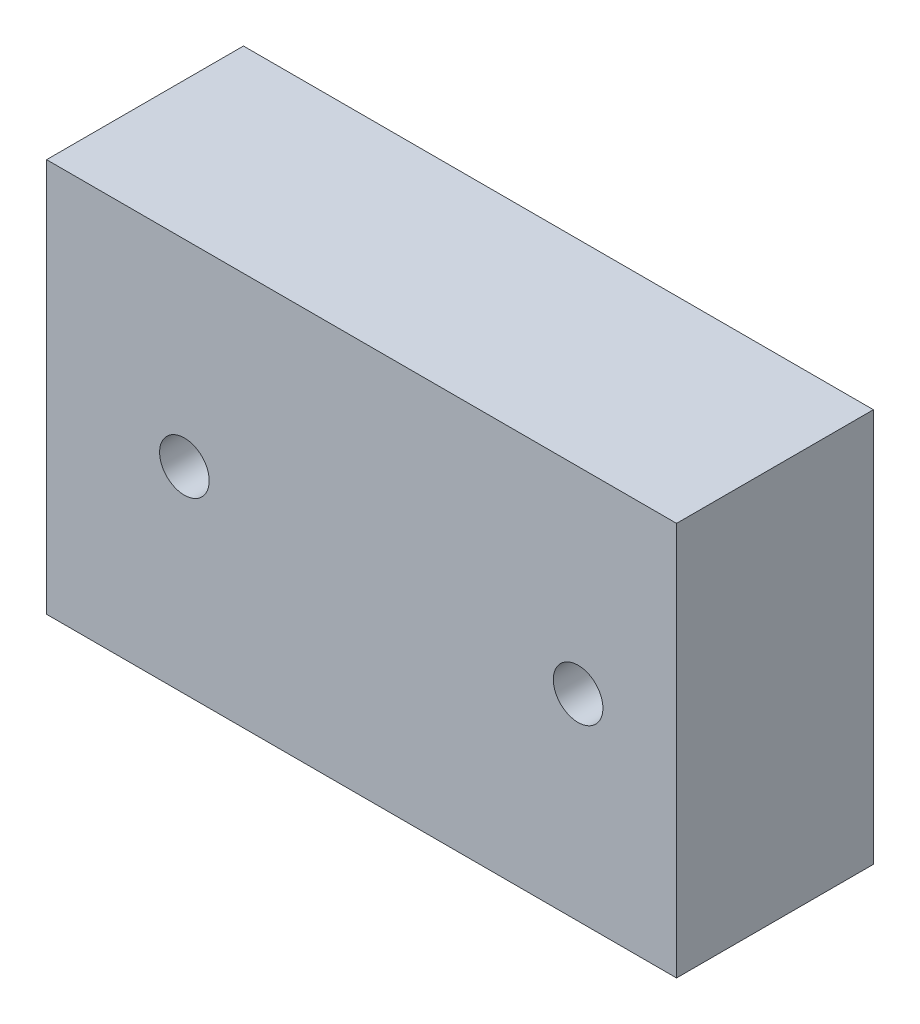
ISO-10303-21;
HEADER;
FILE_DESCRIPTION(('STEP AP214'),'2;1');
FILE_NAME('part.step','',(''),(''),'','','');
FILE_SCHEMA(('AUTOMOTIVE_DESIGN { 1 0 10303 214 1 1 1 1 }'));
ENDSEC;
DATA;
#1=APPLICATION_CONTEXT('core data for automotive mechanical design processes');
#2=APPLICATION_PROTOCOL_DEFINITION('international standard','automotive_design',2000,#1);
#3=PRODUCT_CONTEXT('',#1,'mechanical');
#4=PRODUCT('Part','Part','',(#3));
#5=PRODUCT_RELATED_PRODUCT_CATEGORY('part','',(#4));
#6=PRODUCT_DEFINITION_FORMATION('','',#4);
#7=PRODUCT_DEFINITION_CONTEXT('part definition',#1,'design');
#8=PRODUCT_DEFINITION('design','',#6,#7);
#9=PRODUCT_DEFINITION_SHAPE('','',#8);
#10=(LENGTH_UNIT() NAMED_UNIT(*) SI_UNIT(.MILLI.,.METRE.));
#11=(NAMED_UNIT(*) PLANE_ANGLE_UNIT() SI_UNIT($,.RADIAN.));
#12=(NAMED_UNIT(*) SI_UNIT($,.STERADIAN.) SOLID_ANGLE_UNIT());
#13=UNCERTAINTY_MEASURE_WITH_UNIT(LENGTH_MEASURE(1.E-05),#10,'distance_accuracy_value','');
#14=(GEOMETRIC_REPRESENTATION_CONTEXT(3) GLOBAL_UNCERTAINTY_ASSIGNED_CONTEXT((#13)) GLOBAL_UNIT_ASSIGNED_CONTEXT((#10,
#11,#12)) REPRESENTATION_CONTEXT('',''));
#15=CARTESIAN_POINT('',(0.,0.,0.));
#16=DIRECTION('',(0.,0.,1.));
#17=DIRECTION('',(1.,0.,0.));
#18=AXIS2_PLACEMENT_3D('',#15,#16,#17);
#19=CARTESIAN_POINT('',(0.,0.,6.35));
#20=DIRECTION('',(1.,0.,0.));
#21=DIRECTION('',(0.,0.,-1.));
#22=AXIS2_PLACEMENT_3D('',#19,#20,#21);
#23=PLANE('',#22);
#24=DIRECTION('',(0.,-1.,0.));
#25=VECTOR('',#24,1.);
#26=CARTESIAN_POINT('',(0.,0.,0.));
#27=LINE('',#26,#25);
#28=CARTESIAN_POINT('',(0.,12.7,0.));
#29=VERTEX_POINT('',#28);
#30=CARTESIAN_POINT('',(0.,0.,0.));
#31=VERTEX_POINT('',#30);
#32=EDGE_CURVE('E101',#29,#31,#27,.T.);
#33=ORIENTED_EDGE('',*,*,#32,.T.);
#34=DIRECTION('',(0.,0.,-1.));
#35=VECTOR('',#34,1.);
#36=CARTESIAN_POINT('',(0.,0.,6.35));
#37=LINE('',#36,#35);
#38=CARTESIAN_POINT('',(0.,0.,6.35));
#39=VERTEX_POINT('',#38);
#40=EDGE_CURVE('E11',#39,#31,#37,.T.);
#41=ORIENTED_EDGE('',*,*,#40,.F.);
#42=DIRECTION('',(0.,-1.,0.));
#43=VECTOR('',#42,1.);
#44=CARTESIAN_POINT('',(0.,0.,6.35));
#45=LINE('',#44,#43);
#46=CARTESIAN_POINT('',(0.,12.7,6.35));
#47=VERTEX_POINT('',#46);
#48=EDGE_CURVE('E89',#47,#39,#45,.T.);
#49=ORIENTED_EDGE('',*,*,#48,.F.);
#50=DIRECTION('',(0.,0.,-1.));
#51=VECTOR('',#50,1.);
#52=CARTESIAN_POINT('',(0.,12.7,6.35));
#53=LINE('',#52,#51);
#54=EDGE_CURVE('E97',#47,#29,#53,.T.);
#55=ORIENTED_EDGE('',*,*,#54,.T.);
#56=EDGE_LOOP('',(#33,#41,#49,#55));
#57=FACE_BOUND('',#56,.T.);
#58=ADVANCED_FACE('F38',(#57),#23,.F.);
#59=CARTESIAN_POINT('',(0.,0.,6.35));
#60=DIRECTION('',(0.,1.,0.));
#61=DIRECTION('',(0.,0.,1.));
#62=AXIS2_PLACEMENT_3D('',#59,#60,#61);
#63=PLANE('',#62);
#64=DIRECTION('',(1.,0.,0.));
#65=VECTOR('',#64,1.);
#66=CARTESIAN_POINT('',(0.,0.,0.));
#67=LINE('',#66,#65);
#68=CARTESIAN_POINT('',(20.32,0.,0.));
#69=VERTEX_POINT('',#68);
#70=EDGE_CURVE('E93',#31,#69,#67,.T.);
#71=ORIENTED_EDGE('',*,*,#70,.T.);
#72=DIRECTION('',(0.,0.,-1.));
#73=VECTOR('',#72,1.);
#74=CARTESIAN_POINT('',(20.32,0.,6.35));
#75=LINE('',#74,#73);
#76=CARTESIAN_POINT('',(20.32,0.,6.35));
#77=VERTEX_POINT('',#76);
#78=EDGE_CURVE('E46',#77,#69,#75,.T.);
#79=ORIENTED_EDGE('',*,*,#78,.F.);
#80=DIRECTION('',(1.,0.,0.));
#81=VECTOR('',#80,1.);
#82=CARTESIAN_POINT('',(0.,0.,6.35));
#83=LINE('',#82,#81);
#84=EDGE_CURVE('E84',#39,#77,#83,.T.);
#85=ORIENTED_EDGE('',*,*,#84,.F.);
#86=ORIENTED_EDGE('',*,*,#40,.T.);
#87=EDGE_LOOP('',(#71,#79,#85,#86));
#88=FACE_BOUND('',#87,.T.);
#89=ADVANCED_FACE('F92',(#88),#63,.F.);
#90=CARTESIAN_POINT('',(20.32,0.,6.35));
#91=DIRECTION('',(-1.,0.,0.));
#92=DIRECTION('',(0.,-1.,0.));
#93=AXIS2_PLACEMENT_3D('',#90,#91,#92);
#94=PLANE('',#93);
#95=DIRECTION('',(0.,1.,0.));
#96=VECTOR('',#95,1.);
#97=CARTESIAN_POINT('',(20.32,0.,0.));
#98=LINE('',#97,#96);
#99=CARTESIAN_POINT('',(20.32,12.7,0.));
#100=VERTEX_POINT('',#99);
#101=EDGE_CURVE('E71',#69,#100,#98,.T.);
#102=ORIENTED_EDGE('',*,*,#101,.T.);
#103=DIRECTION('',(0.,0.,-1.));
#104=VECTOR('',#103,1.);
#105=CARTESIAN_POINT('',(20.32,12.7,6.35));
#106=LINE('',#105,#104);
#107=CARTESIAN_POINT('',(20.32,12.7,6.35));
#108=VERTEX_POINT('',#107);
#109=EDGE_CURVE('E94',#108,#100,#106,.T.);
#110=ORIENTED_EDGE('',*,*,#109,.F.);
#111=DIRECTION('',(0.,1.,0.));
#112=VECTOR('',#111,1.);
#113=CARTESIAN_POINT('',(20.32,0.,6.35));
#114=LINE('',#113,#112);
#115=EDGE_CURVE('E87',#77,#108,#114,.T.);
#116=ORIENTED_EDGE('',*,*,#115,.F.);
#117=ORIENTED_EDGE('',*,*,#78,.T.);
#118=EDGE_LOOP('',(#102,#110,#116,#117));
#119=FACE_BOUND('',#118,.T.);
#120=ADVANCED_FACE('F95',(#119),#94,.F.);
#121=CARTESIAN_POINT('',(0.,12.7,6.35));
#122=DIRECTION('',(0.,-1.,0.));
#123=DIRECTION('',(0.,0.,-1.));
#124=AXIS2_PLACEMENT_3D('',#121,#122,#123);
#125=PLANE('',#124);
#126=DIRECTION('',(-1.,0.,0.));
#127=VECTOR('',#126,1.);
#128=CARTESIAN_POINT('',(0.,12.7,0.));
#129=LINE('',#128,#127);
#130=EDGE_CURVE('E77',#100,#29,#129,.T.);
#131=ORIENTED_EDGE('',*,*,#130,.T.);
#132=ORIENTED_EDGE('',*,*,#54,.F.);
#133=DIRECTION('',(-1.,0.,0.));
#134=VECTOR('',#133,1.);
#135=CARTESIAN_POINT('',(0.,12.7,6.35));
#136=LINE('',#135,#134);
#137=EDGE_CURVE('E54',#108,#47,#136,.T.);
#138=ORIENTED_EDGE('',*,*,#137,.F.);
#139=ORIENTED_EDGE('',*,*,#109,.T.);
#140=EDGE_LOOP('',(#131,#132,#138,#139));
#141=FACE_BOUND('',#140,.T.);
#142=ADVANCED_FACE('F109',(#141),#125,.F.);
#143=CARTESIAN_POINT('',(0.,0.,6.35));
#144=DIRECTION('',(0.,0.,-1.));
#145=DIRECTION('',(-1.,0.,0.));
#146=AXIS2_PLACEMENT_3D('',#143,#144,#145);
#147=PLANE('',#146);
#148=CARTESIAN_POINT('',(4.445,6.35,6.35));
#149=DIRECTION('',(0.,0.,1.));
#150=DIRECTION('',(1.,0.,0.));
#151=AXIS2_PLACEMENT_3D('',#148,#149,#150);
#152=CIRCLE('',#151,0.799999999999988);
#153=CARTESIAN_POINT('',(5.24499999999999,6.35,6.35));
#154=VERTEX_POINT('',#153);
#155=EDGE_CURVE('E123',#154,#154,#152,.T.);
#156=ORIENTED_EDGE('',*,*,#155,.F.);
#157=EDGE_LOOP('',(#156));
#158=FACE_BOUND('',#157,.T.);
#159=CARTESIAN_POINT('',(17.145,6.35,6.35));
#160=DIRECTION('',(0.,0.,1.));
#161=DIRECTION('',(1.,0.,0.));
#162=AXIS2_PLACEMENT_3D('',#159,#160,#161);
#163=CIRCLE('',#162,0.799999999999988);
#164=CARTESIAN_POINT('',(17.945,6.35,6.35));
#165=VERTEX_POINT('',#164);
#166=EDGE_CURVE('E117',#165,#165,#163,.T.);
#167=ORIENTED_EDGE('',*,*,#166,.F.);
#168=EDGE_LOOP('',(#167));
#169=FACE_BOUND('',#168,.T.);
#170=ORIENTED_EDGE('',*,*,#48,.T.);
#171=ORIENTED_EDGE('',*,*,#84,.T.);
#172=ORIENTED_EDGE('',*,*,#115,.T.);
#173=ORIENTED_EDGE('',*,*,#137,.T.);
#174=EDGE_LOOP('',(#170,#171,#172,#173));
#175=FACE_BOUND('',#174,.T.);
#176=ADVANCED_FACE('F85',(#158,#169,#175),#147,.F.);
#177=CARTESIAN_POINT('',(0.,0.,0.));
#178=DIRECTION('',(0.,0.,-1.));
#179=DIRECTION('',(-1.,0.,0.));
#180=AXIS2_PLACEMENT_3D('',#177,#178,#179);
#181=PLANE('',#180);
#182=CARTESIAN_POINT('',(4.445,6.35,0.));
#183=DIRECTION('',(0.,0.,1.));
#184=DIRECTION('',(1.,0.,0.));
#185=AXIS2_PLACEMENT_3D('',#182,#183,#184);
#186=CIRCLE('',#185,0.799999999999988);
#187=CARTESIAN_POINT('',(5.24499999999999,6.35,0.));
#188=VERTEX_POINT('',#187);
#189=EDGE_CURVE('E120',#188,#188,#186,.T.);
#190=ORIENTED_EDGE('',*,*,#189,.T.);
#191=EDGE_LOOP('',(#190));
#192=FACE_BOUND('',#191,.T.);
#193=CARTESIAN_POINT('',(17.145,6.35,0.));
#194=DIRECTION('',(0.,0.,1.));
#195=DIRECTION('',(1.,0.,0.));
#196=AXIS2_PLACEMENT_3D('',#193,#194,#195);
#197=CIRCLE('',#196,0.799999999999988);
#198=CARTESIAN_POINT('',(17.945,6.35,0.));
#199=VERTEX_POINT('',#198);
#200=EDGE_CURVE('E104',#199,#199,#197,.T.);
#201=ORIENTED_EDGE('',*,*,#200,.T.);
#202=EDGE_LOOP('',(#201));
#203=FACE_BOUND('',#202,.T.);
#204=ORIENTED_EDGE('',*,*,#32,.F.);
#205=ORIENTED_EDGE('',*,*,#130,.F.);
#206=ORIENTED_EDGE('',*,*,#101,.F.);
#207=ORIENTED_EDGE('',*,*,#70,.F.);
#208=EDGE_LOOP('',(#204,#205,#206,#207));
#209=FACE_BOUND('',#208,.T.);
#210=ADVANCED_FACE('F112',(#192,#203,#209),#181,.T.);
#211=CARTESIAN_POINT('',(17.145,6.35,6.35));
#212=DIRECTION('',(0.,0.,1.));
#213=DIRECTION('',(1.,0.,0.));
#214=AXIS2_PLACEMENT_3D('',#211,#212,#213);
#215=CYLINDRICAL_SURFACE('',#214,0.799999999999988);
#216=ORIENTED_EDGE('',*,*,#200,.F.);
#217=EDGE_LOOP('',(#216));
#218=FACE_BOUND('',#217,.T.);
#219=ORIENTED_EDGE('',*,*,#166,.T.);
#220=EDGE_LOOP('',(#219));
#221=FACE_BOUND('',#220,.T.);
#222=ADVANCED_FACE('F134',(#218,#221),#215,.F.);
#223=CARTESIAN_POINT('',(4.445,6.35,6.35));
#224=DIRECTION('',(0.,0.,1.));
#225=DIRECTION('',(1.,0.,0.));
#226=AXIS2_PLACEMENT_3D('',#223,#224,#225);
#227=CYLINDRICAL_SURFACE('',#226,0.799999999999988);
#228=ORIENTED_EDGE('',*,*,#189,.F.);
#229=EDGE_LOOP('',(#228));
#230=FACE_BOUND('',#229,.T.);
#231=ORIENTED_EDGE('',*,*,#155,.T.);
#232=EDGE_LOOP('',(#231));
#233=FACE_BOUND('',#232,.T.);
#234=ADVANCED_FACE('F127',(#230,#233),#227,.F.);
#235=CLOSED_SHELL('',(#58,#89,#120,#142,#176,#210,#222,#234));
#236=MANIFOLD_SOLID_BREP('B2',#235);
#237=ADVANCED_BREP_SHAPE_REPRESENTATION('',(#18,#236),#14);
#238=SHAPE_DEFINITION_REPRESENTATION(#9,#237);
ENDSEC;
END-ISO-10303-21;
